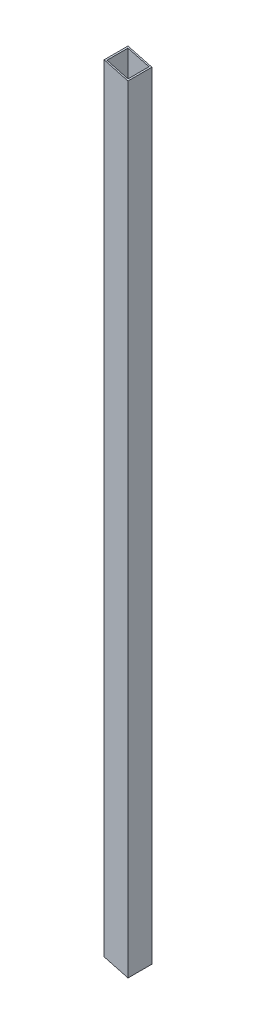
ISO-10303-21;
HEADER;
FILE_DESCRIPTION(('STEP AP214'),'2;1');
FILE_NAME('part.step','',(''),(''),'','','');
FILE_SCHEMA(('AUTOMOTIVE_DESIGN { 1 0 10303 214 1 1 1 1 }'));
ENDSEC;
DATA;
#1=APPLICATION_CONTEXT('core data for automotive mechanical design processes');
#2=APPLICATION_PROTOCOL_DEFINITION('international standard','automotive_design',2000,#1);
#3=PRODUCT_CONTEXT('',#1,'mechanical');
#4=PRODUCT('Part','Part','',(#3));
#5=PRODUCT_RELATED_PRODUCT_CATEGORY('part','',(#4));
#6=PRODUCT_DEFINITION_FORMATION('','',#4);
#7=PRODUCT_DEFINITION_CONTEXT('part definition',#1,'design');
#8=PRODUCT_DEFINITION('design','',#6,#7);
#9=PRODUCT_DEFINITION_SHAPE('','',#8);
#10=(LENGTH_UNIT() NAMED_UNIT(*) SI_UNIT(.MILLI.,.METRE.));
#11=(NAMED_UNIT(*) PLANE_ANGLE_UNIT() SI_UNIT($,.RADIAN.));
#12=(NAMED_UNIT(*) SI_UNIT($,.STERADIAN.) SOLID_ANGLE_UNIT());
#13=UNCERTAINTY_MEASURE_WITH_UNIT(LENGTH_MEASURE(1.E-05),#10,'distance_accuracy_value','');
#14=(GEOMETRIC_REPRESENTATION_CONTEXT(3) GLOBAL_UNCERTAINTY_ASSIGNED_CONTEXT((#13)) GLOBAL_UNIT_ASSIGNED_CONTEXT((#10,
#11,#12)) REPRESENTATION_CONTEXT('',''));
#15=CARTESIAN_POINT('',(0.,0.,0.));
#16=DIRECTION('',(0.,0.,1.));
#17=DIRECTION('',(1.,0.,0.));
#18=AXIS2_PLACEMENT_3D('',#15,#16,#17);
#19=CARTESIAN_POINT('',(-25.4,877.062,-17.395189486807));
#20=DIRECTION('',(1.,0.,0.));
#21=DIRECTION('',(0.,0.,-1.));
#22=AXIS2_PLACEMENT_3D('',#19,#20,#21);
#23=PLANE('',#22);
#24=DIRECTION('',(0.,-1.,0.));
#25=VECTOR('',#24,1.);
#26=CARTESIAN_POINT('',(-25.4,877.062,-17.395189486807));
#27=LINE('',#26,#25);
#28=CARTESIAN_POINT('',(-25.4,877.062,-17.395189486807));
#29=VERTEX_POINT('',#28);
#30=CARTESIAN_POINT('',(-25.4,50.8000000000002,-17.395189486807));
#31=VERTEX_POINT('',#30);
#32=EDGE_CURVE('E132',#29,#31,#27,.T.);
#33=ORIENTED_EDGE('',*,*,#32,.T.);
#34=DIRECTION('',(0.,0.,-1.));
#35=VECTOR('',#34,1.);
#36=CARTESIAN_POINT('',(-25.4,50.8,8.00486551319299));
#37=LINE('',#36,#35);
#38=CARTESIAN_POINT('',(-25.4,50.8,8.00481051319299));
#39=VERTEX_POINT('',#38);
#40=EDGE_CURVE('E54',#39,#31,#37,.T.);
#41=ORIENTED_EDGE('',*,*,#40,.F.);
#42=DIRECTION('',(0.,-1.,0.));
#43=VECTOR('',#42,1.);
#44=CARTESIAN_POINT('',(-25.4,877.062,8.00481051319299));
#45=LINE('',#44,#43);
#46=CARTESIAN_POINT('',(-25.4,877.062,8.00481051319299));
#47=VERTEX_POINT('',#46);
#48=EDGE_CURVE('E119',#47,#39,#45,.T.);
#49=ORIENTED_EDGE('',*,*,#48,.F.);
#50=DIRECTION('',(0.,0.,1.));
#51=VECTOR('',#50,1.);
#52=CARTESIAN_POINT('',(-25.4,877.062,-17.395189486807));
#53=LINE('',#52,#51);
#54=EDGE_CURVE('E138',#29,#47,#53,.T.);
#55=ORIENTED_EDGE('',*,*,#54,.F.);
#56=EDGE_LOOP('',(#33,#41,#49,#55));
#57=FACE_BOUND('',#56,.T.);
#58=ADVANCED_FACE('F39',(#57),#23,.F.);
#59=CARTESIAN_POINT('',(-25.4,877.062,8.00481051319299));
#60=DIRECTION('',(0.,0.,-1.));
#61=DIRECTION('',(-1.,0.,0.));
#62=AXIS2_PLACEMENT_3D('',#59,#60,#61);
#63=PLANE('',#62);
#64=ORIENTED_EDGE('',*,*,#48,.T.);
#65=DIRECTION('',(0.965925826289066,-0.25881904510253,0.));
#66=VECTOR('',#65,1.);
#67=CARTESIAN_POINT('',(-231.965500000007,106.149058909135,8.00481051319299));
#68=LINE('',#67,#66);
#69=CARTESIAN_POINT('',(0.,43.9940905122492,8.00481051319298));
#70=VERTEX_POINT('',#69);
#71=EDGE_CURVE('E104',#39,#70,#68,.T.);
#72=ORIENTED_EDGE('',*,*,#71,.T.);
#73=DIRECTION('',(0.,-1.,0.));
#74=VECTOR('',#73,1.);
#75=CARTESIAN_POINT('',(0.,877.062,8.00481051319299));
#76=LINE('',#75,#74);
#77=CARTESIAN_POINT('',(0.,870.25609051225,8.00481051319299));
#78=VERTEX_POINT('',#77);
#79=EDGE_CURVE('E117',#78,#70,#76,.T.);
#80=ORIENTED_EDGE('',*,*,#79,.F.);
#81=DIRECTION('',(-0.965925826289071,0.258819045102513,0.));
#82=VECTOR('',#81,1.);
#83=CARTESIAN_POINT('',(-25.4,877.062,8.00481051319299));
#84=LINE('',#83,#82);
#85=EDGE_CURVE('E168',#78,#47,#84,.T.);
#86=ORIENTED_EDGE('',*,*,#85,.T.);
#87=EDGE_LOOP('',(#64,#72,#80,#86));
#88=FACE_BOUND('',#87,.T.);
#89=ADVANCED_FACE('F115',(#88),#63,.F.);
#90=CARTESIAN_POINT('',(0.,877.062,-17.395189486807));
#91=DIRECTION('',(-1.,0.,0.));
#92=DIRECTION('',(0.,0.,1.));
#93=AXIS2_PLACEMENT_3D('',#90,#91,#92);
#94=PLANE('',#93);
#95=ORIENTED_EDGE('',*,*,#79,.T.);
#96=DIRECTION('',(0.,0.,-1.));
#97=VECTOR('',#96,1.);
#98=CARTESIAN_POINT('',(0.,43.9940905122492,8.00486551319299));
#99=LINE('',#98,#97);
#100=CARTESIAN_POINT('',(0.,43.9940905122492,-17.395189486807));
#101=VERTEX_POINT('',#100);
#102=EDGE_CURVE('E101',#70,#101,#99,.T.);
#103=ORIENTED_EDGE('',*,*,#102,.T.);
#104=DIRECTION('',(0.,-1.,0.));
#105=VECTOR('',#104,1.);
#106=CARTESIAN_POINT('',(0.,877.062,-17.395189486807));
#107=LINE('',#106,#105);
#108=CARTESIAN_POINT('',(0.,870.25609051225,-17.395189486807));
#109=VERTEX_POINT('',#108);
#110=EDGE_CURVE('E127',#109,#101,#107,.T.);
#111=ORIENTED_EDGE('',*,*,#110,.F.);
#112=DIRECTION('',(0.,0.,1.));
#113=VECTOR('',#112,1.);
#114=CARTESIAN_POINT('',(0.,870.25609051225,-17.395189486807));
#115=LINE('',#114,#113);
#116=EDGE_CURVE('E125',#109,#78,#115,.T.);
#117=ORIENTED_EDGE('',*,*,#116,.T.);
#118=EDGE_LOOP('',(#95,#103,#111,#117));
#119=FACE_BOUND('',#118,.T.);
#120=ADVANCED_FACE('F124',(#119),#94,.F.);
#121=CARTESIAN_POINT('',(-25.4,877.062,-17.395189486807));
#122=DIRECTION('',(0.,0.,1.));
#123=DIRECTION('',(1.,0.,0.));
#124=AXIS2_PLACEMENT_3D('',#121,#122,#123);
#125=PLANE('',#124);
#126=ORIENTED_EDGE('',*,*,#110,.T.);
#127=DIRECTION('',(-0.965925826289066,0.25881904510253,0.));
#128=VECTOR('',#127,1.);
#129=CARTESIAN_POINT('',(-231.965500000007,106.149058909135,-17.395189486807));
#130=LINE('',#129,#128);
#131=EDGE_CURVE('E105',#101,#31,#130,.T.);
#132=ORIENTED_EDGE('',*,*,#131,.T.);
#133=ORIENTED_EDGE('',*,*,#32,.F.);
#134=DIRECTION('',(0.96592582628907,-0.258819045102512,0.));
#135=VECTOR('',#134,1.);
#136=CARTESIAN_POINT('',(-25.4,877.062,-17.395189486807));
#137=LINE('',#136,#135);
#138=EDGE_CURVE('E121',#29,#109,#137,.T.);
#139=ORIENTED_EDGE('',*,*,#138,.T.);
#140=EDGE_LOOP('',(#126,#132,#133,#139));
#141=FACE_BOUND('',#140,.T.);
#142=ADVANCED_FACE('F229',(#141),#125,.F.);
#143=CARTESIAN_POINT('',(-23.876,877.062,-15.871189486807));
#144=DIRECTION('',(1.,0.,0.));
#145=DIRECTION('',(0.,0.,-1.));
#146=AXIS2_PLACEMENT_3D('',#143,#144,#145);
#147=PLANE('',#146);
#148=DIRECTION('',(0.,0.,1.));
#149=VECTOR('',#148,1.);
#150=CARTESIAN_POINT('',(-23.876,50.3916454307349,-15.871189486807));
#151=LINE('',#150,#149);
#152=CARTESIAN_POINT('',(-23.876,50.3916454307349,-15.871189486807));
#153=VERTEX_POINT('',#152);
#154=CARTESIAN_POINT('',(-23.876,50.3916454307349,6.48081051319299));
#155=VERTEX_POINT('',#154);
#156=EDGE_CURVE('E189',#153,#155,#151,.T.);
#157=ORIENTED_EDGE('',*,*,#156,.F.);
#158=DIRECTION('',(0.,-1.,0.));
#159=VECTOR('',#158,1.);
#160=CARTESIAN_POINT('',(-23.876,877.062,-15.871189486807));
#161=LINE('',#160,#159);
#162=CARTESIAN_POINT('',(-23.876,876.653645430735,-15.871189486807));
#163=VERTEX_POINT('',#162);
#164=EDGE_CURVE('E164',#163,#153,#161,.T.);
#165=ORIENTED_EDGE('',*,*,#164,.F.);
#166=DIRECTION('',(0.,0.,-1.));
#167=VECTOR('',#166,1.);
#168=CARTESIAN_POINT('',(-23.876,876.653645430735,-15.871189486807));
#169=LINE('',#168,#167);
#170=CARTESIAN_POINT('',(-23.876,876.653645430735,6.48081051319299));
#171=VERTEX_POINT('',#170);
#172=EDGE_CURVE('E173',#171,#163,#169,.T.);
#173=ORIENTED_EDGE('',*,*,#172,.F.);
#174=DIRECTION('',(0.,-1.,0.));
#175=VECTOR('',#174,1.);
#176=CARTESIAN_POINT('',(-23.876,877.062,6.48081051319299));
#177=LINE('',#176,#175);
#178=EDGE_CURVE('E141',#171,#155,#177,.T.);
#179=ORIENTED_EDGE('',*,*,#178,.T.);
#180=EDGE_LOOP('',(#157,#165,#173,#179));
#181=FACE_BOUND('',#180,.T.);
#182=ADVANCED_FACE('F211',(#181),#147,.T.);
#183=CARTESIAN_POINT('',(-23.876,877.062,6.48081051319299));
#184=DIRECTION('',(0.,0.,-1.));
#185=DIRECTION('',(-1.,0.,0.));
#186=AXIS2_PLACEMENT_3D('',#183,#184,#185);
#187=PLANE('',#186);
#188=DIRECTION('',(0.965925826289066,-0.25881904510253,0.));
#189=VECTOR('',#188,1.);
#190=CARTESIAN_POINT('',(-230.543588642323,105.768058909135,6.48081051319299));
#191=LINE('',#190,#189);
#192=CARTESIAN_POINT('',(-1.524,44.4024450815143,6.48081051319298));
#193=VERTEX_POINT('',#192);
#194=EDGE_CURVE('E192',#155,#193,#191,.T.);
#195=ORIENTED_EDGE('',*,*,#194,.F.);
#196=ORIENTED_EDGE('',*,*,#178,.F.);
#197=DIRECTION('',(-0.965925826289071,0.258819045102513,0.));
#198=VECTOR('',#197,1.);
#199=CARTESIAN_POINT('',(-23.9780886423162,876.681,6.48081051319299));
#200=LINE('',#199,#198);
#201=CARTESIAN_POINT('',(-1.524,870.664445081515,6.48081051319298));
#202=VERTEX_POINT('',#201);
#203=EDGE_CURVE('E176',#202,#171,#200,.T.);
#204=ORIENTED_EDGE('',*,*,#203,.F.);
#205=DIRECTION('',(0.,-1.,0.));
#206=VECTOR('',#205,1.);
#207=CARTESIAN_POINT('',(-1.524,877.062,6.48081051319299));
#208=LINE('',#207,#206);
#209=EDGE_CURVE('E150',#202,#193,#208,.T.);
#210=ORIENTED_EDGE('',*,*,#209,.T.);
#211=EDGE_LOOP('',(#195,#196,#204,#210));
#212=FACE_BOUND('',#211,.T.);
#213=ADVANCED_FACE('F206',(#212),#187,.T.);
#214=CARTESIAN_POINT('',(-1.524,877.062,-15.871189486807));
#215=DIRECTION('',(-1.,0.,0.));
#216=DIRECTION('',(0.,0.,1.));
#217=AXIS2_PLACEMENT_3D('',#214,#215,#216);
#218=PLANE('',#217);
#219=DIRECTION('',(0.,0.,-1.));
#220=VECTOR('',#219,1.);
#221=CARTESIAN_POINT('',(-1.524,44.4024450815143,-15.871189486807));
#222=LINE('',#221,#220);
#223=CARTESIAN_POINT('',(-1.524,44.4024450815144,-15.871189486807));
#224=VERTEX_POINT('',#223);
#225=EDGE_CURVE('E61',#193,#224,#222,.T.);
#226=ORIENTED_EDGE('',*,*,#225,.F.);
#227=ORIENTED_EDGE('',*,*,#209,.F.);
#228=DIRECTION('',(0.,0.,1.));
#229=VECTOR('',#228,1.);
#230=CARTESIAN_POINT('',(-1.524,870.664445081515,-15.871189486807));
#231=LINE('',#230,#229);
#232=CARTESIAN_POINT('',(-1.524,870.664445081515,-15.871189486807));
#233=VERTEX_POINT('',#232);
#234=EDGE_CURVE('E179',#233,#202,#231,.T.);
#235=ORIENTED_EDGE('',*,*,#234,.F.);
#236=DIRECTION('',(0.,-1.,0.));
#237=VECTOR('',#236,1.);
#238=CARTESIAN_POINT('',(-1.524,877.062,-15.871189486807));
#239=LINE('',#238,#237);
#240=EDGE_CURVE('E158',#233,#224,#239,.T.);
#241=ORIENTED_EDGE('',*,*,#240,.T.);
#242=EDGE_LOOP('',(#226,#227,#235,#241));
#243=FACE_BOUND('',#242,.T.);
#244=ADVANCED_FACE('F202',(#243),#218,.T.);
#245=CARTESIAN_POINT('',(-23.876,877.062,-15.871189486807));
#246=DIRECTION('',(0.,0.,1.));
#247=DIRECTION('',(1.,0.,0.));
#248=AXIS2_PLACEMENT_3D('',#245,#246,#247);
#249=PLANE('',#248);
#250=DIRECTION('',(-0.965925826289066,0.25881904510253,0.));
#251=VECTOR('',#250,1.);
#252=CARTESIAN_POINT('',(-230.543588642323,105.768058909135,-15.871189486807));
#253=LINE('',#252,#251);
#254=EDGE_CURVE('E11',#224,#153,#253,.T.);
#255=ORIENTED_EDGE('',*,*,#254,.F.);
#256=ORIENTED_EDGE('',*,*,#240,.F.);
#257=DIRECTION('',(0.965925826289071,-0.258819045102513,0.));
#258=VECTOR('',#257,1.);
#259=CARTESIAN_POINT('',(-23.9780886423163,876.681,-15.871189486807));
#260=LINE('',#259,#258);
#261=EDGE_CURVE('E47',#163,#233,#260,.T.);
#262=ORIENTED_EDGE('',*,*,#261,.F.);
#263=ORIENTED_EDGE('',*,*,#164,.T.);
#264=EDGE_LOOP('',(#255,#256,#262,#263));
#265=FACE_BOUND('',#264,.T.);
#266=ADVANCED_FACE('F213',(#265),#249,.T.);
#267=CARTESIAN_POINT('',(-25.4,877.062,-17.395189486807));
#268=DIRECTION('',(-0.258819045102513,-0.965925826289071,0.));
#269=DIRECTION('',(0.965925826289071,-0.258819045102513,0.));
#270=AXIS2_PLACEMENT_3D('',#267,#268,#269);
#271=PLANE('',#270);
#272=ORIENTED_EDGE('',*,*,#172,.T.);
#273=ORIENTED_EDGE('',*,*,#261,.T.);
#274=ORIENTED_EDGE('',*,*,#234,.T.);
#275=ORIENTED_EDGE('',*,*,#203,.T.);
#276=EDGE_LOOP('',(#272,#273,#274,#275));
#277=FACE_BOUND('',#276,.T.);
#278=ORIENTED_EDGE('',*,*,#116,.F.);
#279=ORIENTED_EDGE('',*,*,#138,.F.);
#280=ORIENTED_EDGE('',*,*,#54,.T.);
#281=ORIENTED_EDGE('',*,*,#85,.F.);
#282=EDGE_LOOP('',(#278,#279,#280,#281));
#283=FACE_BOUND('',#282,.T.);
#284=ADVANCED_FACE('F208',(#277,#283),#271,.F.);
#285=CARTESIAN_POINT('',(-25.4,50.8,8.00486551319299));
#286=DIRECTION('',(0.25881904510253,0.965925826289066,0.));
#287=DIRECTION('',(-0.965925826289066,0.25881904510253,0.));
#288=AXIS2_PLACEMENT_3D('',#285,#286,#287);
#289=PLANE('',#288);
#290=ORIENTED_EDGE('',*,*,#156,.T.);
#291=ORIENTED_EDGE('',*,*,#194,.T.);
#292=ORIENTED_EDGE('',*,*,#225,.T.);
#293=ORIENTED_EDGE('',*,*,#254,.T.);
#294=EDGE_LOOP('',(#290,#291,#292,#293));
#295=FACE_BOUND('',#294,.T.);
#296=ORIENTED_EDGE('',*,*,#40,.T.);
#297=ORIENTED_EDGE('',*,*,#131,.F.);
#298=ORIENTED_EDGE('',*,*,#102,.F.);
#299=ORIENTED_EDGE('',*,*,#71,.F.);
#300=EDGE_LOOP('',(#296,#297,#298,#299));
#301=FACE_BOUND('',#300,.T.);
#302=ADVANCED_FACE('F103',(#295,#301),#289,.F.);
#303=CLOSED_SHELL('',(#58,#89,#120,#142,#182,#213,#244,#266,#284,#302));
#304=MANIFOLD_SOLID_BREP('B2',#303);
#305=ADVANCED_BREP_SHAPE_REPRESENTATION('',(#18,#304),#14);
#306=SHAPE_DEFINITION_REPRESENTATION(#9,#305);
ENDSEC;
END-ISO-10303-21;
